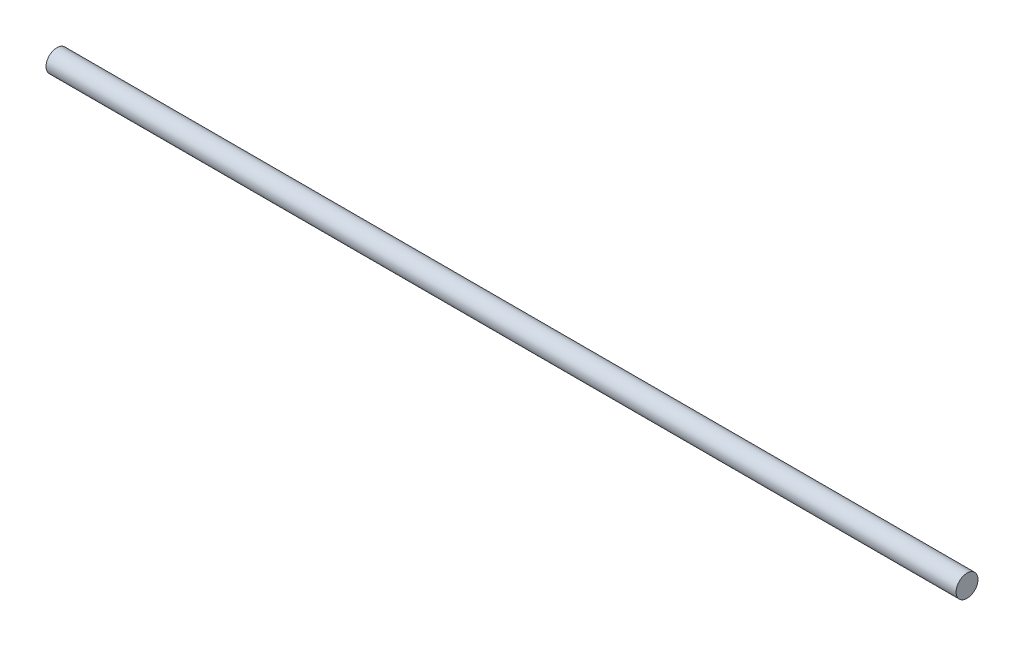
ISO-10303-21;
HEADER;
FILE_DESCRIPTION(('STEP AP214'),'2;1');
FILE_NAME('part.step','',(''),(''),'','','');
FILE_SCHEMA(('AUTOMOTIVE_DESIGN { 1 0 10303 214 1 1 1 1 }'));
ENDSEC;
DATA;
#1=APPLICATION_CONTEXT('core data for automotive mechanical design processes');
#2=APPLICATION_PROTOCOL_DEFINITION('international standard','automotive_design',2000,#1);
#3=PRODUCT_CONTEXT('',#1,'mechanical');
#4=PRODUCT('Part','Part','',(#3));
#5=PRODUCT_RELATED_PRODUCT_CATEGORY('part','',(#4));
#6=PRODUCT_DEFINITION_FORMATION('','',#4);
#7=PRODUCT_DEFINITION_CONTEXT('part definition',#1,'design');
#8=PRODUCT_DEFINITION('design','',#6,#7);
#9=PRODUCT_DEFINITION_SHAPE('','',#8);
#10=(LENGTH_UNIT() NAMED_UNIT(*) SI_UNIT(.MILLI.,.METRE.));
#11=(NAMED_UNIT(*) PLANE_ANGLE_UNIT() SI_UNIT($,.RADIAN.));
#12=(NAMED_UNIT(*) SI_UNIT($,.STERADIAN.) SOLID_ANGLE_UNIT());
#13=UNCERTAINTY_MEASURE_WITH_UNIT(LENGTH_MEASURE(1.E-05),#10,'distance_accuracy_value','');
#14=(GEOMETRIC_REPRESENTATION_CONTEXT(3) GLOBAL_UNCERTAINTY_ASSIGNED_CONTEXT((#13)) GLOBAL_UNIT_ASSIGNED_CONTEXT((#10,
#11,#12)) REPRESENTATION_CONTEXT('',''));
#15=CARTESIAN_POINT('',(0.,0.,0.));
#16=DIRECTION('',(0.,0.,1.));
#17=DIRECTION('',(1.,0.,0.));
#18=AXIS2_PLACEMENT_3D('',#15,#16,#17);
#19=CARTESIAN_POINT('',(124.5,0.,0.));
#20=DIRECTION('',(1.,0.,0.));
#21=DIRECTION('',(0.,1.,0.));
#22=AXIS2_PLACEMENT_3D('',#19,#20,#21);
#23=PLANE('',#22);
#24=CARTESIAN_POINT('',(124.5,0.,0.));
#25=DIRECTION('',(-1.,0.,0.));
#26=DIRECTION('',(0.,-1.,0.));
#27=AXIS2_PLACEMENT_3D('',#24,#25,#26);
#28=CIRCLE('',#27,3.00000000000011);
#29=CARTESIAN_POINT('',(124.5,-3.00000000000008,0.));
#30=VERTEX_POINT('',#29);
#31=EDGE_CURVE('E10',#30,#30,#28,.T.);
#32=ORIENTED_EDGE('',*,*,#31,.F.);
#33=EDGE_LOOP('',(#32));
#34=FACE_BOUND('',#33,.T.);
#35=ADVANCED_FACE('F51',(#34),#23,.T.);
#36=CARTESIAN_POINT('',(-124.5,0.,0.));
#37=DIRECTION('',(-1.,0.,0.));
#38=DIRECTION('',(0.,-1.,0.));
#39=AXIS2_PLACEMENT_3D('',#36,#37,#38);
#40=CYLINDRICAL_SURFACE('',#39,3.00000000000012);
#41=CARTESIAN_POINT('',(-124.5,0.,0.));
#42=DIRECTION('',(-1.,0.,0.));
#43=DIRECTION('',(0.,-1.,0.));
#44=AXIS2_PLACEMENT_3D('',#41,#42,#43);
#45=CIRCLE('',#44,3.00000000000012);
#46=CARTESIAN_POINT('',(-124.5,-3.00000000000012,0.));
#47=VERTEX_POINT('',#46);
#48=EDGE_CURVE('E58',#47,#47,#45,.T.);
#49=ORIENTED_EDGE('',*,*,#48,.F.);
#50=EDGE_LOOP('',(#49));
#51=FACE_BOUND('',#50,.T.);
#52=ORIENTED_EDGE('',*,*,#31,.T.);
#53=EDGE_LOOP('',(#52));
#54=FACE_BOUND('',#53,.T.);
#55=ADVANCED_FACE('F67',(#51,#54),#40,.T.);
#56=CARTESIAN_POINT('',(-124.5,0.,0.));
#57=DIRECTION('',(1.,0.,0.));
#58=DIRECTION('',(0.,1.,0.));
#59=AXIS2_PLACEMENT_3D('',#56,#57,#58);
#60=PLANE('',#59);
#61=ORIENTED_EDGE('',*,*,#48,.T.);
#62=EDGE_LOOP('',(#61));
#63=FACE_BOUND('',#62,.T.);
#64=ADVANCED_FACE('F65',(#63),#60,.F.);
#65=CLOSED_SHELL('',(#35,#55,#64));
#66=MANIFOLD_SOLID_BREP('B2',#65);
#67=ADVANCED_BREP_SHAPE_REPRESENTATION('',(#18,#66),#14);
#68=SHAPE_DEFINITION_REPRESENTATION(#9,#67);
ENDSEC;
END-ISO-10303-21;
